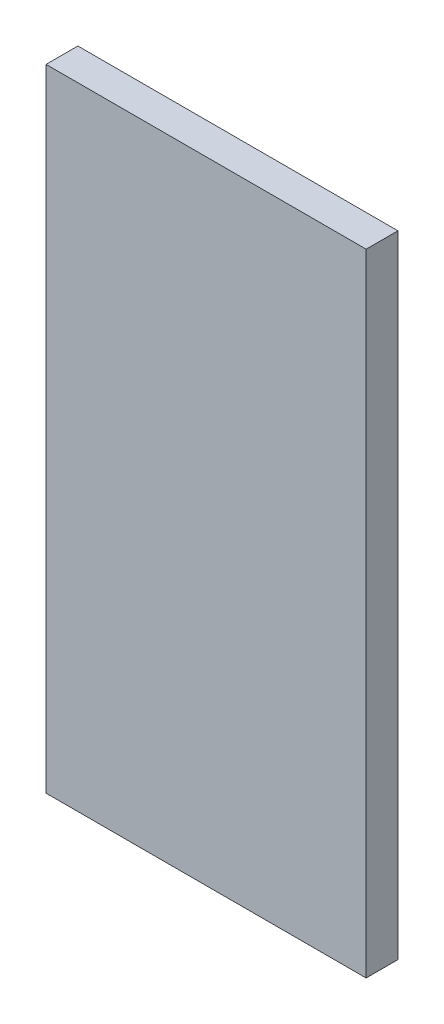
ISO-10303-21;
HEADER;
FILE_DESCRIPTION(('STEP AP214'),'2;1');
FILE_NAME('part.step','',(''),(''),'','','');
FILE_SCHEMA(('AUTOMOTIVE_DESIGN { 1 0 10303 214 1 1 1 1 }'));
ENDSEC;
DATA;
#1=APPLICATION_CONTEXT('core data for automotive mechanical design processes');
#2=APPLICATION_PROTOCOL_DEFINITION('international standard','automotive_design',2000,#1);
#3=PRODUCT_CONTEXT('',#1,'mechanical');
#4=PRODUCT('Part','Part','',(#3));
#5=PRODUCT_RELATED_PRODUCT_CATEGORY('part','',(#4));
#6=PRODUCT_DEFINITION_FORMATION('','',#4);
#7=PRODUCT_DEFINITION_CONTEXT('part definition',#1,'design');
#8=PRODUCT_DEFINITION('design','',#6,#7);
#9=PRODUCT_DEFINITION_SHAPE('','',#8);
#10=(LENGTH_UNIT() NAMED_UNIT(*) SI_UNIT(.MILLI.,.METRE.));
#11=(NAMED_UNIT(*) PLANE_ANGLE_UNIT() SI_UNIT($,.RADIAN.));
#12=(NAMED_UNIT(*) SI_UNIT($,.STERADIAN.) SOLID_ANGLE_UNIT());
#13=UNCERTAINTY_MEASURE_WITH_UNIT(LENGTH_MEASURE(1.E-05),#10,'distance_accuracy_value','');
#14=(GEOMETRIC_REPRESENTATION_CONTEXT(3) GLOBAL_UNCERTAINTY_ASSIGNED_CONTEXT((#13)) GLOBAL_UNIT_ASSIGNED_CONTEXT((#10,
#11,#12)) REPRESENTATION_CONTEXT('',''));
#15=CARTESIAN_POINT('',(0.,0.,0.));
#16=DIRECTION('',(0.,0.,1.));
#17=DIRECTION('',(1.,0.,0.));
#18=AXIS2_PLACEMENT_3D('',#15,#16,#17);
#19=CARTESIAN_POINT('',(-34.7341501976284,40.455138339921,7.69));
#20=DIRECTION('',(1.,0.,0.));
#21=DIRECTION('',(0.,1.,0.));
#22=AXIS2_PLACEMENT_3D('',#19,#20,#21);
#23=PLANE('',#22);
#24=DIRECTION('',(0.,-1.,0.));
#25=VECTOR('',#24,1.);
#26=CARTESIAN_POINT('',(-34.7341501976284,40.455138339921,0.));
#27=LINE('',#26,#25);
#28=CARTESIAN_POINT('',(-34.7341501976284,40.455138339921,0.));
#29=VERTEX_POINT('',#28);
#30=CARTESIAN_POINT('',(-34.7341501976284,-112.134861660079,0.));
#31=VERTEX_POINT('',#30);
#32=EDGE_CURVE('E96',#29,#31,#27,.T.);
#33=ORIENTED_EDGE('',*,*,#32,.T.);
#34=DIRECTION('',(0.,0.,-1.));
#35=VECTOR('',#34,1.);
#36=CARTESIAN_POINT('',(-34.7341501976284,-112.134861660079,7.69));
#37=LINE('',#36,#35);
#38=CARTESIAN_POINT('',(-34.7341501976284,-112.134861660079,7.69));
#39=VERTEX_POINT('',#38);
#40=EDGE_CURVE('E11',#39,#31,#37,.T.);
#41=ORIENTED_EDGE('',*,*,#40,.F.);
#42=DIRECTION('',(0.,-1.,0.));
#43=VECTOR('',#42,1.);
#44=CARTESIAN_POINT('',(-34.7341501976284,40.455138339921,7.69));
#45=LINE('',#44,#43);
#46=CARTESIAN_POINT('',(-34.7341501976284,40.455138339921,7.69));
#47=VERTEX_POINT('',#46);
#48=EDGE_CURVE('E84',#47,#39,#45,.T.);
#49=ORIENTED_EDGE('',*,*,#48,.F.);
#50=DIRECTION('',(0.,0.,-1.));
#51=VECTOR('',#50,1.);
#52=CARTESIAN_POINT('',(-34.7341501976284,40.455138339921,7.69));
#53=LINE('',#52,#51);
#54=EDGE_CURVE('E92',#47,#29,#53,.T.);
#55=ORIENTED_EDGE('',*,*,#54,.T.);
#56=EDGE_LOOP('',(#33,#41,#49,#55));
#57=FACE_BOUND('',#56,.T.);
#58=ADVANCED_FACE('F33',(#57),#23,.F.);
#59=CARTESIAN_POINT('',(-34.7341501976284,-112.134861660079,7.69));
#60=DIRECTION('',(0.,1.,0.));
#61=DIRECTION('',(0.,0.,1.));
#62=AXIS2_PLACEMENT_3D('',#59,#60,#61);
#63=PLANE('',#62);
#64=DIRECTION('',(1.,0.,0.));
#65=VECTOR('',#64,1.);
#66=CARTESIAN_POINT('',(-34.7341501976284,-112.134861660079,0.));
#67=LINE('',#66,#65);
#68=CARTESIAN_POINT('',(42.6458498023716,-112.134861660079,0.));
#69=VERTEX_POINT('',#68);
#70=EDGE_CURVE('E88',#31,#69,#67,.T.);
#71=ORIENTED_EDGE('',*,*,#70,.T.);
#72=DIRECTION('',(0.,0.,-1.));
#73=VECTOR('',#72,1.);
#74=CARTESIAN_POINT('',(42.6458498023716,-112.134861660079,7.69));
#75=LINE('',#74,#73);
#76=CARTESIAN_POINT('',(42.6458498023716,-112.134861660079,7.69));
#77=VERTEX_POINT('',#76);
#78=EDGE_CURVE('E41',#77,#69,#75,.T.);
#79=ORIENTED_EDGE('',*,*,#78,.F.);
#80=DIRECTION('',(1.,0.,0.));
#81=VECTOR('',#80,1.);
#82=CARTESIAN_POINT('',(-34.7341501976284,-112.134861660079,7.69));
#83=LINE('',#82,#81);
#84=EDGE_CURVE('E79',#39,#77,#83,.T.);
#85=ORIENTED_EDGE('',*,*,#84,.F.);
#86=ORIENTED_EDGE('',*,*,#40,.T.);
#87=EDGE_LOOP('',(#71,#79,#85,#86));
#88=FACE_BOUND('',#87,.T.);
#89=ADVANCED_FACE('F87',(#88),#63,.F.);
#90=CARTESIAN_POINT('',(42.6458498023715,40.455138339921,7.69));
#91=DIRECTION('',(-1.,0.,0.));
#92=DIRECTION('',(0.,-1.,0.));
#93=AXIS2_PLACEMENT_3D('',#90,#91,#92);
#94=PLANE('',#93);
#95=DIRECTION('',(0.,1.,0.));
#96=VECTOR('',#95,1.);
#97=CARTESIAN_POINT('',(42.6458498023715,40.455138339921,0.));
#98=LINE('',#97,#96);
#99=CARTESIAN_POINT('',(42.6458498023715,40.455138339921,0.));
#100=VERTEX_POINT('',#99);
#101=EDGE_CURVE('E66',#69,#100,#98,.T.);
#102=ORIENTED_EDGE('',*,*,#101,.T.);
#103=DIRECTION('',(0.,0.,-1.));
#104=VECTOR('',#103,1.);
#105=CARTESIAN_POINT('',(42.6458498023715,40.455138339921,7.69));
#106=LINE('',#105,#104);
#107=CARTESIAN_POINT('',(42.6458498023715,40.455138339921,7.69));
#108=VERTEX_POINT('',#107);
#109=EDGE_CURVE('E89',#108,#100,#106,.T.);
#110=ORIENTED_EDGE('',*,*,#109,.F.);
#111=DIRECTION('',(0.,1.,0.));
#112=VECTOR('',#111,1.);
#113=CARTESIAN_POINT('',(42.6458498023715,40.455138339921,7.69));
#114=LINE('',#113,#112);
#115=EDGE_CURVE('E82',#77,#108,#114,.T.);
#116=ORIENTED_EDGE('',*,*,#115,.F.);
#117=ORIENTED_EDGE('',*,*,#78,.T.);
#118=EDGE_LOOP('',(#102,#110,#116,#117));
#119=FACE_BOUND('',#118,.T.);
#120=ADVANCED_FACE('F90',(#119),#94,.F.);
#121=CARTESIAN_POINT('',(-34.7341501976284,40.455138339921,7.69));
#122=DIRECTION('',(0.,-1.,0.));
#123=DIRECTION('',(0.,0.,-1.));
#124=AXIS2_PLACEMENT_3D('',#121,#122,#123);
#125=PLANE('',#124);
#126=DIRECTION('',(-1.,0.,0.));
#127=VECTOR('',#126,1.);
#128=CARTESIAN_POINT('',(-34.7341501976284,40.455138339921,0.));
#129=LINE('',#128,#127);
#130=EDGE_CURVE('E72',#100,#29,#129,.T.);
#131=ORIENTED_EDGE('',*,*,#130,.T.);
#132=ORIENTED_EDGE('',*,*,#54,.F.);
#133=DIRECTION('',(-1.,0.,0.));
#134=VECTOR('',#133,1.);
#135=CARTESIAN_POINT('',(-34.7341501976284,40.455138339921,7.69));
#136=LINE('',#135,#134);
#137=EDGE_CURVE('E49',#108,#47,#136,.T.);
#138=ORIENTED_EDGE('',*,*,#137,.F.);
#139=ORIENTED_EDGE('',*,*,#109,.T.);
#140=EDGE_LOOP('',(#131,#132,#138,#139));
#141=FACE_BOUND('',#140,.T.);
#142=ADVANCED_FACE('F103',(#141),#125,.F.);
#143=CARTESIAN_POINT('',(0.,0.,7.69));
#144=DIRECTION('',(0.,0.,1.));
#145=DIRECTION('',(1.,0.,0.));
#146=AXIS2_PLACEMENT_3D('',#143,#144,#145);
#147=PLANE('',#146);
#148=ORIENTED_EDGE('',*,*,#48,.T.);
#149=ORIENTED_EDGE('',*,*,#84,.T.);
#150=ORIENTED_EDGE('',*,*,#115,.T.);
#151=ORIENTED_EDGE('',*,*,#137,.T.);
#152=EDGE_LOOP('',(#148,#149,#150,#151));
#153=FACE_BOUND('',#152,.T.);
#154=ADVANCED_FACE('F80',(#153),#147,.T.);
#155=CARTESIAN_POINT('',(0.,0.,0.));
#156=DIRECTION('',(0.,0.,1.));
#157=DIRECTION('',(1.,0.,0.));
#158=AXIS2_PLACEMENT_3D('',#155,#156,#157);
#159=PLANE('',#158);
#160=ORIENTED_EDGE('',*,*,#32,.F.);
#161=ORIENTED_EDGE('',*,*,#130,.F.);
#162=ORIENTED_EDGE('',*,*,#101,.F.);
#163=ORIENTED_EDGE('',*,*,#70,.F.);
#164=EDGE_LOOP('',(#160,#161,#162,#163));
#165=FACE_BOUND('',#164,.T.);
#166=ADVANCED_FACE('F106',(#165),#159,.F.);
#167=CLOSED_SHELL('',(#58,#89,#120,#142,#154,#166));
#168=MANIFOLD_SOLID_BREP('B2',#167);
#169=ADVANCED_BREP_SHAPE_REPRESENTATION('',(#18,#168),#14);
#170=SHAPE_DEFINITION_REPRESENTATION(#9,#169);
ENDSEC;
END-ISO-10303-21;
